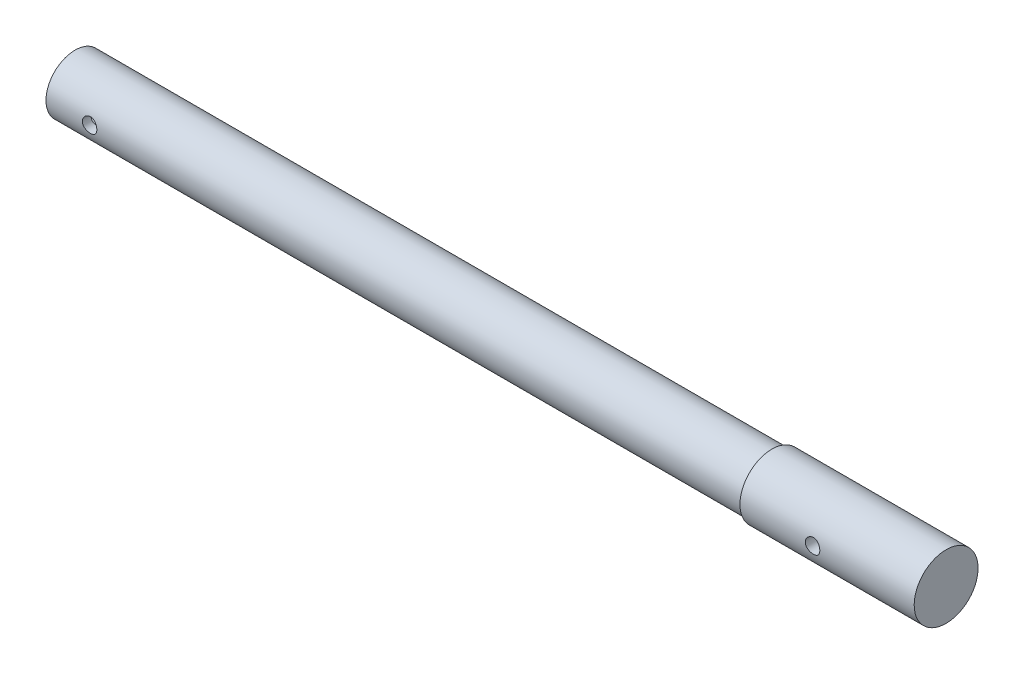
ISO-10303-21;
HEADER;
FILE_DESCRIPTION(('STEP AP214'),'2;1');
FILE_NAME('part.step','',(''),(''),'','','');
FILE_SCHEMA(('AUTOMOTIVE_DESIGN { 1 0 10303 214 1 1 1 1 }'));
ENDSEC;
DATA;
#1=APPLICATION_CONTEXT('core data for automotive mechanical design processes');
#2=APPLICATION_PROTOCOL_DEFINITION('international standard','automotive_design',2000,#1);
#3=PRODUCT_CONTEXT('',#1,'mechanical');
#4=PRODUCT('Part','Part','',(#3));
#5=PRODUCT_RELATED_PRODUCT_CATEGORY('part','',(#4));
#6=PRODUCT_DEFINITION_FORMATION('','',#4);
#7=PRODUCT_DEFINITION_CONTEXT('part definition',#1,'design');
#8=PRODUCT_DEFINITION('design','',#6,#7);
#9=PRODUCT_DEFINITION_SHAPE('','',#8);
#10=(LENGTH_UNIT() NAMED_UNIT(*) SI_UNIT(.MILLI.,.METRE.));
#11=(NAMED_UNIT(*) PLANE_ANGLE_UNIT() SI_UNIT($,.RADIAN.));
#12=(NAMED_UNIT(*) SI_UNIT($,.STERADIAN.) SOLID_ANGLE_UNIT());
#13=UNCERTAINTY_MEASURE_WITH_UNIT(LENGTH_MEASURE(1.E-05),#10,'distance_accuracy_value','');
#14=(GEOMETRIC_REPRESENTATION_CONTEXT(3) GLOBAL_UNCERTAINTY_ASSIGNED_CONTEXT((#13)) GLOBAL_UNIT_ASSIGNED_CONTEXT((#10,
#11,#12)) REPRESENTATION_CONTEXT('',''));
#15=CARTESIAN_POINT('',(0.,0.,0.));
#16=DIRECTION('',(0.,0.,1.));
#17=DIRECTION('',(1.,0.,0.));
#18=AXIS2_PLACEMENT_3D('',#15,#16,#17);
#19=CARTESIAN_POINT('',(0.,0.,0.));
#20=DIRECTION('',(-0.999999999999999,0.,0.));
#21=DIRECTION('',(0.,0.,1.));
#22=AXIS2_PLACEMENT_3D('',#19,#20,#21);
#23=PLANE('',#22);
#24=CARTESIAN_POINT('',(0.,0.,0.));
#25=DIRECTION('',(-0.999999999999999,0.,0.));
#26=DIRECTION('',(0.,0.,1.));
#27=AXIS2_PLACEMENT_3D('',#24,#25,#26);
#28=CIRCLE('',#27,11.);
#29=CARTESIAN_POINT('',(0.,0.,11.));
#30=VERTEX_POINT('',#29);
#31=EDGE_CURVE('E50',#30,#30,#28,.T.);
#32=ORIENTED_EDGE('',*,*,#31,.F.);
#33=EDGE_LOOP('',(#32));
#34=FACE_BOUND('',#33,.T.);
#35=ADVANCED_FACE('F34',(#34),#23,.F.);
#36=CARTESIAN_POINT('',(-299.999999999999,0.,0.));
#37=DIRECTION('',(-0.999999999999999,0.,0.));
#38=DIRECTION('',(0.,0.,1.));
#39=AXIS2_PLACEMENT_3D('',#36,#37,#38);
#40=CYLINDRICAL_SURFACE('',#39,11.);
#41=CARTESIAN_POINT('',(-32.5,0.,-11.));
#42=CARTESIAN_POINT('',(-32.5000045318264,0.138518278596904,-10.9999974735185));
#43=CARTESIAN_POINT('',(-32.5115512275769,0.277090172258007,-10.9973570934613));
#44=CARTESIAN_POINT('',(-32.5573794760617,0.550288594599317,-10.987079320306));
#45=CARTESIAN_POINT('',(-32.5916763959553,0.684912392220719,-10.9794385496265));
#46=CARTESIAN_POINT('',(-32.6818680486319,0.946227671984901,-10.9600095312293));
#47=CARTESIAN_POINT('',(-32.7377393279807,1.07292759495646,-10.9482257885674));
#48=CARTESIAN_POINT('',(-32.8694171133808,1.31515227582564,-10.921778201627));
#49=CARTESIAN_POINT('',(-32.9452234208424,1.4306771450318,-10.9071143860398));
#50=CARTESIAN_POINT('',(-33.1160020446067,1.64926760444636,-10.8762265816814));
#51=CARTESIAN_POINT('',(-33.211252573475,1.75211293892047,-10.8599819758326));
#52=CARTESIAN_POINT('',(-33.4176189741372,1.94051389816609,-10.827906511833));
#53=CARTESIAN_POINT('',(-33.5287363506944,2.02606788121783,-10.8120756930933));
#54=CARTESIAN_POINT('',(-33.7653320552837,2.17844599401786,-10.7824158369221));
#55=CARTESIAN_POINT('',(-33.8909669963058,2.24503254356573,-10.7686131580577));
#56=CARTESIAN_POINT('',(-34.1520095005816,2.35606069717868,-10.7448696147509));
#57=CARTESIAN_POINT('',(-34.2874157920616,2.40050517717748,-10.7349282488167));
#58=CARTESIAN_POINT('',(-34.5617591871165,2.46525349412717,-10.720243446983));
#59=CARTESIAN_POINT('',(-34.7005992631225,2.48594892680751,-10.715415797339));
#60=CARTESIAN_POINT('',(-34.9798582272131,2.50382988451486,-10.7112523406768));
#61=CARTESIAN_POINT('',(-35.1202769026623,2.50101853886554,-10.711915802658));
#62=CARTESIAN_POINT('',(-35.3957728833487,2.47228016958763,-10.7185835035919));
#63=CARTESIAN_POINT('',(-35.5309009061949,2.44681104599436,-10.7244819412976));
#64=CARTESIAN_POINT('',(-35.7949144861548,2.37420684920499,-10.7407873672743));
#65=CARTESIAN_POINT('',(-35.9237996676272,2.32707047404286,-10.7511946264744));
#66=CARTESIAN_POINT('',(-36.1729406718105,2.21205734402542,-10.7754474384537));
#67=CARTESIAN_POINT('',(-36.2931135177637,2.14400712086005,-10.7893215597825));
#68=CARTESIAN_POINT('',(-36.520502553111,1.98921977920406,-10.8189276843241));
#69=CARTESIAN_POINT('',(-36.6277168402639,1.90247992237133,-10.8346599596346));
#70=CARTESIAN_POINT('',(-36.828778561821,1.71036518003516,-10.866661528725));
#71=CARTESIAN_POINT('',(-36.9222544265163,1.60460166742826,-10.882934773515));
#72=CARTESIAN_POINT('',(-37.0902058887071,1.37871229840971,-10.9138502597158));
#73=CARTESIAN_POINT('',(-37.1646810866995,1.2585861400908,-10.9284924668293));
#74=CARTESIAN_POINT('',(-37.2926203879715,1.00690799179916,-10.9545497424637));
#75=CARTESIAN_POINT('',(-37.3460327736223,0.875328834348154,-10.9659568484873));
#76=CARTESIAN_POINT('',(-37.4298840058679,0.604745122491692,-10.9841998956698));
#77=CARTESIAN_POINT('',(-37.4603264658222,0.46574173966372,-10.9910365557784));
#78=CARTESIAN_POINT('',(-37.4968262374727,0.187439840192736,-10.9992650071756));
#79=CARTESIAN_POINT('',(-37.5033906913167,0.0482110923370398,-11.0007700184113));
#80=CARTESIAN_POINT('',(-37.4933269601471,-0.229353886680108,-10.9984842255063));
#81=CARTESIAN_POINT('',(-37.476700480594,-0.367690182720868,-10.9946938107912));
#82=CARTESIAN_POINT('',(-37.4211468330946,-0.637841677218467,-10.9823148103741));
#83=CARTESIAN_POINT('',(-37.3824884535562,-0.769715036814428,-10.973784087055));
#84=CARTESIAN_POINT('',(-37.2842689725429,-1.02510393087761,-10.9528806132367));
#85=CARTESIAN_POINT('',(-37.2247059957468,-1.14861871432291,-10.9405075180554));
#86=CARTESIAN_POINT('',(-37.0853308564447,-1.38586085256058,-10.9130143275094));
#87=CARTESIAN_POINT('',(-37.0052243732268,-1.4994106852272,-10.8978552985532));
#88=CARTESIAN_POINT('',(-36.8274206715598,-1.71163773579052,-10.866546095646));
#89=CARTESIAN_POINT('',(-36.7297209734532,-1.8103128535797,-10.8503957821912));
#90=CARTESIAN_POINT('',(-36.5171690348666,-1.99201706218097,-10.8185287714487));
#91=CARTESIAN_POINT('',(-36.4020127582132,-2.07469366594063,-10.8028272119253));
#92=CARTESIAN_POINT('',(-36.1591536093297,-2.21953814406553,-10.7740023321604));
#93=CARTESIAN_POINT('',(-36.0314512920404,-2.28170692501018,-10.7608788979592));
#94=CARTESIAN_POINT('',(-35.7678195304311,-2.38333597241929,-10.7388274870674));
#95=CARTESIAN_POINT('',(-35.6319426762566,-2.42292716221706,-10.7298753781702));
#96=CARTESIAN_POINT('',(-35.3552330933009,-2.47865258340366,-10.7171411058581));
#97=CARTESIAN_POINT('',(-35.2144012348636,-2.49479091341616,-10.7133580391079));
#98=CARTESIAN_POINT('',(-34.9353413806891,-2.50296739214167,-10.7114502943222));
#99=CARTESIAN_POINT('',(-34.7971304006664,-2.49556548501073,-10.7131941458177));
#100=CARTESIAN_POINT('',(-34.5239810898117,-2.45813115403285,-10.7218446846914));
#101=CARTESIAN_POINT('',(-34.3890427138895,-2.4280990421701,-10.7287513008948));
#102=CARTESIAN_POINT('',(-34.1267566026337,-2.3465369236061,-10.7468826027048));
#103=CARTESIAN_POINT('',(-33.9993803088585,-2.29509457527996,-10.758089666867));
#104=CARTESIAN_POINT('',(-33.7549852930994,-2.17224536606883,-10.783564723281));
#105=CARTESIAN_POINT('',(-33.6379677496745,-2.10083623731226,-10.7978330631965));
#106=CARTESIAN_POINT('',(-33.4148655723447,-1.93824996891053,-10.828211072634));
#107=CARTESIAN_POINT('',(-33.3090742777926,-1.84667645642838,-10.8443540558786));
#108=CARTESIAN_POINT('',(-33.114176814918,-1.6471562893242,-10.8764454859305));
#109=CARTESIAN_POINT('',(-33.025074529034,-1.53920583540677,-10.8923938866664));
#110=CARTESIAN_POINT('',(-32.8648619397663,-1.30814060515057,-10.9225693389041));
#111=CARTESIAN_POINT('',(-32.7940261766668,-1.18483162187621,-10.9367686161711));
#112=CARTESIAN_POINT('',(-32.674200029337,-0.927755967711699,-10.9615640551399));
#113=CARTESIAN_POINT('',(-32.6251920052133,-0.793997844337698,-10.9721631246672));
#114=CARTESIAN_POINT('',(-32.5587720938238,-0.550163071539619,-10.9867559512784));
#115=CARTESIAN_POINT('',(-32.5367760123107,-0.441368111138487,-10.9916908558499));
#116=CARTESIAN_POINT('',(-32.5073885264206,-0.221726814930916,-10.9983138080738));
#117=CARTESIAN_POINT('',(-32.4999963723808,-0.110880584717101,-11.0000020223883));
#118=CARTESIAN_POINT('',(-32.5,0.,-11.));
#119=B_SPLINE_CURVE_WITH_KNOTS('',3,(#41,#42,#43,#44,#45,#46,#47,#48,#49,#50,#51,#52,#53,#54,
#55,#56,#57,#58,#59,#60,#61,#62,#63,#64,#65,#66,#67,#68,#69,#70,#71,#72,#73,#74,#75,#76,#77,#78,
#79,#80,#81,#82,#83,#84,#85,#86,#87,#88,#89,#90,#91,#92,#93,#94,#95,#96,#97,#98,#99,#100,#101,
#102,#103,#104,#105,#106,#107,#108,#109,#110,#111,#112,#113,#114,#115,#116,#117,#118),
.UNSPECIFIED.,.T.,.F.,(4,2,2,2,2,2,2,2,2,2,2,2,2,2,2,2,2,2,2,2,2,2,2,2,2,2,2,2,2,2,2,2,2,2,2,2,
2,2,4),(0.,0.415148849633312,0.830578406996924,1.24555761755317,1.66053269430522,
2.08192389396808,2.50335508365802,2.92985362973412,3.35629676538237,3.77560244898082,
4.19485231368759,4.60581714174236,5.01680666753972,5.43130157438849,5.84585725297976,
6.27011531803702,6.69438230269861,7.11968464096645,7.54492006169893,7.9610694191676,
8.37718817463625,8.78833576149035,9.19952024123082,9.61696129328766,10.0344612272567,
10.4603132154039,10.8861463755948,11.3094844190899,11.732748471094,12.1460204395145,
12.5592867105954,12.9708773657615,13.382514789318,13.8031102578591,14.2238034502007,
14.6504927745347,15.0768366452216,15.4091704772436,15.7414872491401),.UNSPECIFIED.);
#120=CARTESIAN_POINT('',(-32.5,0.,-11.));
#121=VERTEX_POINT('',#120);
#122=EDGE_CURVE('E10',#121,#121,#119,.T.);
#123=ORIENTED_EDGE('',*,*,#122,.T.);
#124=EDGE_LOOP('',(#123));
#125=FACE_BOUND('',#124,.T.);
#126=CARTESIAN_POINT('',(-32.5,0.,11.));
#127=CARTESIAN_POINT('',(-32.5000045318264,-0.138518278596916,10.9999974735186));
#128=CARTESIAN_POINT('',(-32.5115512275769,-0.27709017225802,10.9973570934613));
#129=CARTESIAN_POINT('',(-32.5573794760617,-0.55028859459933,10.987079320306));
#130=CARTESIAN_POINT('',(-32.5916763959553,-0.684912392220732,10.9794385496265));
#131=CARTESIAN_POINT('',(-32.6818680486319,-0.946227671984921,10.9600095312294));
#132=CARTESIAN_POINT('',(-32.7377393279807,-1.07292759495649,10.9482257885674));
#133=CARTESIAN_POINT('',(-32.8694171133808,-1.31515227582568,10.921778201627));
#134=CARTESIAN_POINT('',(-32.9452234208424,-1.43067714503184,10.9071143860399));
#135=CARTESIAN_POINT('',(-33.1160020446066,-1.6492676044464,10.8762265816814));
#136=CARTESIAN_POINT('',(-33.211252573475,-1.75211293892051,10.8599819758326));
#137=CARTESIAN_POINT('',(-33.4176189741372,-1.94051389816612,10.827906511833));
#138=CARTESIAN_POINT('',(-33.5287363506944,-2.02606788121785,10.8120756930933));
#139=CARTESIAN_POINT('',(-33.7653320552837,-2.17844599401789,10.7824158369221));
#140=CARTESIAN_POINT('',(-33.8909669963058,-2.24503254356577,10.7686131580577));
#141=CARTESIAN_POINT('',(-34.1520095005816,-2.35606069717871,10.7448696147509));
#142=CARTESIAN_POINT('',(-34.2874157920616,-2.4005051771775,10.7349282488168));
#143=CARTESIAN_POINT('',(-34.5617591871165,-2.46525349412719,10.7202434469831));
#144=CARTESIAN_POINT('',(-34.7005992631225,-2.48594892680756,10.715415797339));
#145=CARTESIAN_POINT('',(-34.9798582272131,-2.5038298845149,10.7112523406768));
#146=CARTESIAN_POINT('',(-35.1202769026623,-2.50101853886555,10.7119158026581));
#147=CARTESIAN_POINT('',(-35.3957728833487,-2.47228016958765,10.718583503592));
#148=CARTESIAN_POINT('',(-35.5309009061949,-2.44681104599439,10.7244819412976));
#149=CARTESIAN_POINT('',(-35.7949144861548,-2.37420684920503,10.7407873672743));
#150=CARTESIAN_POINT('',(-35.9237996676272,-2.3270704740429,10.7511946264744));
#151=CARTESIAN_POINT('',(-36.1729406718105,-2.21205734402545,10.7754474384537));
#152=CARTESIAN_POINT('',(-36.2931135177637,-2.14400712086009,10.7893215597825));
#153=CARTESIAN_POINT('',(-36.5205025531111,-1.98921977920409,10.8189276843241));
#154=CARTESIAN_POINT('',(-36.6277168402639,-1.90247992237135,10.8346599596346));
#155=CARTESIAN_POINT('',(-36.828778561821,-1.71036518003517,10.8666615287251));
#156=CARTESIAN_POINT('',(-36.9222544265163,-1.60460166742828,10.882934773515));
#157=CARTESIAN_POINT('',(-37.0902058887071,-1.37871229840973,10.9138502597158));
#158=CARTESIAN_POINT('',(-37.1646810866995,-1.25858614009081,10.9284924668294));
#159=CARTESIAN_POINT('',(-37.2926203879715,-1.00690799179917,10.9545497424638));
#160=CARTESIAN_POINT('',(-37.3460327736223,-0.875328834348167,10.9659568484873));
#161=CARTESIAN_POINT('',(-37.4298840058679,-0.604745122491713,10.9841998956698));
#162=CARTESIAN_POINT('',(-37.4603264658222,-0.465741739663744,10.9910365557784));
#163=CARTESIAN_POINT('',(-37.4968262374727,-0.187439840192761,10.9992650071756));
#164=CARTESIAN_POINT('',(-37.5033906913167,-0.048211092337063,11.0007700184113));
#165=CARTESIAN_POINT('',(-37.4933269601471,0.22935388668009,10.9984842255063));
#166=CARTESIAN_POINT('',(-37.476700480594,0.367690182720853,10.9946938107912));
#167=CARTESIAN_POINT('',(-37.4211468330946,0.637841677218447,10.9823148103742));
#168=CARTESIAN_POINT('',(-37.3824884535562,0.769715036814401,10.973784087055));
#169=CARTESIAN_POINT('',(-37.2842689725429,1.02510393087758,10.9528806132367));
#170=CARTESIAN_POINT('',(-37.2247059957468,1.14861871432287,10.9405075180555));
#171=CARTESIAN_POINT('',(-37.0853308564447,1.38586085256054,10.9130143275095));
#172=CARTESIAN_POINT('',(-37.0052243732268,1.49941068522716,10.8978552985532));
#173=CARTESIAN_POINT('',(-36.8274206715598,1.71163773579048,10.866546095646));
#174=CARTESIAN_POINT('',(-36.7297209734532,1.81031285357967,10.8503957821913));
#175=CARTESIAN_POINT('',(-36.5171690348666,1.99201706218093,10.8185287714487));
#176=CARTESIAN_POINT('',(-36.4020127582132,2.07469366594058,10.8028272119253));
#177=CARTESIAN_POINT('',(-36.1591536093297,2.2195381440655,10.7740023321604));
#178=CARTESIAN_POINT('',(-36.0314512920404,2.28170692501016,10.7608788979593));
#179=CARTESIAN_POINT('',(-35.7678195304311,2.38333597241927,10.7388274870674));
#180=CARTESIAN_POINT('',(-35.6319426762566,2.42292716221702,10.7298753781702));
#181=CARTESIAN_POINT('',(-35.3552330933009,2.47865258340363,10.7171411058581));
#182=CARTESIAN_POINT('',(-35.2144012348636,2.49479091341615,10.713358039108));
#183=CARTESIAN_POINT('',(-34.9353413806891,2.50296739214166,10.7114502943223));
#184=CARTESIAN_POINT('',(-34.7971304006664,2.4955654850107,10.7131941458177));
#185=CARTESIAN_POINT('',(-34.5239810898117,2.4581311540328,10.7218446846914));
#186=CARTESIAN_POINT('',(-34.3890427138895,2.42809904217007,10.7287513008948));
#187=CARTESIAN_POINT('',(-34.1267566026337,2.34653692360607,10.7468826027049));
#188=CARTESIAN_POINT('',(-33.9993803088585,2.29509457527993,10.758089666867));
#189=CARTESIAN_POINT('',(-33.7549852930994,2.17224536606878,10.7835647232811));
#190=CARTESIAN_POINT('',(-33.6379677496745,2.10083623731222,10.7978330631966));
#191=CARTESIAN_POINT('',(-33.4148655723447,1.93824996891048,10.8282110726341));
#192=CARTESIAN_POINT('',(-33.3090742777926,1.84667645642833,10.8443540558786));
#193=CARTESIAN_POINT('',(-33.114176814918,1.64715628932417,10.8764454859305));
#194=CARTESIAN_POINT('',(-33.025074529034,1.53920583540675,10.8923938866665));
#195=CARTESIAN_POINT('',(-32.8648619397663,1.30814060515056,10.9225693389041));
#196=CARTESIAN_POINT('',(-32.7940261766668,1.18483162187619,10.9367686161711));
#197=CARTESIAN_POINT('',(-32.674200029337,0.927755967711683,10.9615640551399));
#198=CARTESIAN_POINT('',(-32.6251920052133,0.793997844337689,10.9721631246672));
#199=CARTESIAN_POINT('',(-32.5587720938238,0.550163071539611,10.9867559512784));
#200=CARTESIAN_POINT('',(-32.5367760123107,0.441368111138475,10.9916908558499));
#201=CARTESIAN_POINT('',(-32.5073885264206,0.221726814930901,10.9983138080738));
#202=CARTESIAN_POINT('',(-32.4999963723808,0.110880584717087,11.0000020223883));
#203=CARTESIAN_POINT('',(-32.5,0.,11.));
#204=B_SPLINE_CURVE_WITH_KNOTS('',3,(#126,#127,#128,#129,#130,#131,#132,#133,#134,#135,#136,
#137,#138,#139,#140,#141,#142,#143,#144,#145,#146,#147,#148,#149,#150,#151,#152,#153,#154,#155,
#156,#157,#158,#159,#160,#161,#162,#163,#164,#165,#166,#167,#168,#169,#170,#171,#172,#173,#174,
#175,#176,#177,#178,#179,#180,#181,#182,#183,#184,#185,#186,#187,#188,#189,#190,#191,#192,#193,
#194,#195,#196,#197,#198,#199,#200,#201,#202,#203),.UNSPECIFIED.,.T.,.F.,(4,2,2,2,2,2,2,2,2,2,2,
2,2,2,2,2,2,2,2,2,2,2,2,2,2,2,2,2,2,2,2,2,2,2,2,2,2,2,4),(0.,0.415148849633311,
0.830578406996924,1.24555761755319,1.66053269430525,2.08192389396809,2.50335508365803,
2.92985362973414,3.35629676538238,3.77560244898084,4.19485231368761,4.60581714174238,
5.01680666753974,5.43130157438852,5.84585725297979,6.27011531803706,6.69438230269865,
7.11968464096649,7.54492006169895,7.96106941916763,8.37718817463629,8.78833576149037,
9.19952024123083,9.61696129328767,10.0344612272567,10.460313215404,10.8861463755948,
11.3094844190899,11.732748471094,12.1460204395146,12.5592867105954,12.9708773657615,
13.382514789318,13.8031102578591,14.2238034502007,14.6504927745347,15.0768366452216,
15.4091704772436,15.74148724914),.UNSPECIFIED.);
#205=CARTESIAN_POINT('',(-32.5,0.,11.));
#206=VERTEX_POINT('',#205);
#207=EDGE_CURVE('E45',#206,#206,#204,.T.);
#208=ORIENTED_EDGE('',*,*,#207,.T.);
#209=EDGE_LOOP('',(#208));
#210=FACE_BOUND('',#209,.T.);
#211=CARTESIAN_POINT('',(-60.,0.,0.));
#212=DIRECTION('',(-0.999999999999999,0.,0.));
#213=DIRECTION('',(0.,0.,1.));
#214=AXIS2_PLACEMENT_3D('',#211,#212,#213);
#215=CIRCLE('',#214,11.);
#216=CARTESIAN_POINT('',(-60.,0.,11.));
#217=VERTEX_POINT('',#216);
#218=EDGE_CURVE('E122',#217,#217,#215,.T.);
#219=ORIENTED_EDGE('',*,*,#218,.F.);
#220=EDGE_LOOP('',(#219));
#221=FACE_BOUND('',#220,.T.);
#222=ORIENTED_EDGE('',*,*,#31,.T.);
#223=EDGE_LOOP('',(#222));
#224=FACE_BOUND('',#223,.T.);
#225=ADVANCED_FACE('F61',(#125,#210,#221,#224),#40,.T.);
#226=CARTESIAN_POINT('',(-60.,11.,0.));
#227=DIRECTION('',(0.999999999999999,0.,0.));
#228=DIRECTION('',(0.,0.,-1.));
#229=AXIS2_PLACEMENT_3D('',#226,#227,#228);
#230=PLANE('',#229);
#231=CARTESIAN_POINT('',(-60.,0.,0.));
#232=DIRECTION('',(-0.999999999999999,0.,0.));
#233=DIRECTION('',(0.,0.,1.));
#234=AXIS2_PLACEMENT_3D('',#231,#232,#233);
#235=CIRCLE('',#234,10.);
#236=CARTESIAN_POINT('',(-60.,0.,10.));
#237=VERTEX_POINT('',#236);
#238=EDGE_CURVE('E124',#237,#237,#235,.T.);
#239=ORIENTED_EDGE('',*,*,#238,.F.);
#240=EDGE_LOOP('',(#239));
#241=FACE_BOUND('',#240,.T.);
#242=ORIENTED_EDGE('',*,*,#218,.T.);
#243=EDGE_LOOP('',(#242));
#244=FACE_BOUND('',#243,.T.);
#245=ADVANCED_FACE('F80',(#241,#244),#230,.F.);
#246=CARTESIAN_POINT('',(-299.999999999999,0.,0.));
#247=DIRECTION('',(-0.999999999999999,0.,0.));
#248=DIRECTION('',(0.,0.,1.));
#249=AXIS2_PLACEMENT_3D('',#246,#247,#248);
#250=CYLINDRICAL_SURFACE('',#249,9.99999999999999);
#251=CARTESIAN_POINT('',(-282.5,0.,10.));
#252=CARTESIAN_POINT('',(-282.50000387623,-0.138126814449554,9.99999766446688));
#253=CARTESIAN_POINT('',(-282.511485917956,-0.276296929717936,9.99710963553043));
#254=CARTESIAN_POINT('',(-282.557041918845,-0.548677206284232,9.98586856383157));
#255=CARTESIAN_POINT('',(-282.591128682563,-0.682885078117928,9.97751242366628));
#256=CARTESIAN_POINT('',(-282.680732089103,-0.943368120304304,9.95626043886721));
#257=CARTESIAN_POINT('',(-282.736222997858,-1.06965260571664,9.94337004736763));
#258=CARTESIAN_POINT('',(-282.866968983408,-1.31112021984068,9.91442239679369));
#259=CARTESIAN_POINT('',(-282.942224726864,-1.42630297391461,9.89836503090263));
#260=CARTESIAN_POINT('',(-283.11200131609,-1.64466987883488,9.86445689319491));
#261=CARTESIAN_POINT('',(-283.206852624931,-1.74759281676842,9.84657845246877));
#262=CARTESIAN_POINT('',(-283.412420341515,-1.93624821200553,9.8112270019656));
#263=CARTESIAN_POINT('',(-283.523138538244,-2.02197872824868,9.79375403816448));
#264=CARTESIAN_POINT('',(-283.759325377895,-2.17504423799833,9.76091292830283));
#265=CARTESIAN_POINT('',(-283.884988718014,-2.24208702654191,9.74557990774684));
#266=CARTESIAN_POINT('',(-284.146247352766,-2.35399484758459,9.71915824696693));
#267=CARTESIAN_POINT('',(-284.281841055553,-2.39886342573361,9.70806892824033));
#268=CARTESIAN_POINT('',(-284.556239163669,-2.46425806134132,9.6916746116054));
#269=CARTESIAN_POINT('',(-284.69492482673,-2.48525378055345,9.68625818328351));
#270=CARTESIAN_POINT('',(-284.973947614998,-2.5037696251107,9.68148937432651));
#271=CARTESIAN_POINT('',(-285.11428446782,-2.50129356969688,9.68213600713215));
#272=CARTESIAN_POINT('',(-285.389026346242,-2.47331087439956,9.68932009194695));
#273=CARTESIAN_POINT('',(-285.523492702442,-2.44836390031778,9.69571438345487));
#274=CARTESIAN_POINT('',(-285.786268418185,-2.37704031150504,9.71344516118447));
#275=CARTESIAN_POINT('',(-285.914577338381,-2.33066217011568,9.72478199948733));
#276=CARTESIAN_POINT('',(-286.162896693753,-2.21731579656199,9.75125189842767));
#277=CARTESIAN_POINT('',(-286.282810286316,-2.15014444538824,9.76642212449692));
#278=CARTESIAN_POINT('',(-286.509864516261,-1.99726046002495,9.79882851409984));
#279=CARTESIAN_POINT('',(-286.617002913445,-1.91154458134809,9.81606503891048));
#280=CARTESIAN_POINT('',(-286.818672692824,-1.72110570780206,9.85126467566487));
#281=CARTESIAN_POINT('',(-286.912757483435,-1.61591043027648,9.8692344913));
#282=CARTESIAN_POINT('',(-287.082035404106,-1.39101986250622,9.90343275964592));
#283=CARTESIAN_POINT('',(-287.157227957106,-1.27132412951329,9.9196611591568));
#284=CARTESIAN_POINT('',(-287.28675097704,-1.02019314780236,9.94862886823652));
#285=CARTESIAN_POINT('',(-287.341008900424,-0.888718988681079,9.96135600212878));
#286=CARTESIAN_POINT('',(-287.426528842849,-0.618126680238168,9.9817986165236));
#287=CARTESIAN_POINT('',(-287.457795260696,-0.479009998584165,9.9895150556547));
#288=CARTESIAN_POINT('',(-287.495762609264,-0.200899950650064,9.99892498785626));
#289=CARTESIAN_POINT('',(-287.503071710125,-0.0619945333137042,10.0007675584713));
#290=CARTESIAN_POINT('',(-287.494584996574,0.215054791335818,9.99864674690753));
#291=CARTESIAN_POINT('',(-287.478791262001,0.35319876607429,9.99468388736423));
#292=CARTESIAN_POINT('',(-287.425048486014,0.622690447960789,9.9814930187892));
#293=CARTESIAN_POINT('',(-287.387431227538,0.754108531614571,9.97234390309646));
#294=CARTESIAN_POINT('',(-287.291488193285,1.00876215408751,9.94981177723595));
#295=CARTESIAN_POINT('',(-287.233160326144,1.13199686505439,9.93642833949967));
#296=CARTESIAN_POINT('',(-287.096273118542,1.36920522404969,9.90655513210372));
#297=CARTESIAN_POINT('',(-287.017373146005,1.48297573639294,9.89001445611));
#298=CARTESIAN_POINT('',(-286.842016818671,1.69587768940553,9.85574181979585));
#299=CARTESIAN_POINT('',(-286.74555743397,1.79500659828875,9.83800965421577));
#300=CARTESIAN_POINT('',(-286.534996731927,1.97831761345415,9.80281594932497));
#301=CARTESIAN_POINT('',(-286.420520495,2.06207311270187,9.78537173637461));
#302=CARTESIAN_POINT('',(-286.178778942552,2.20918459835607,9.75321463970069));
#303=CARTESIAN_POINT('',(-286.051514195049,2.27254149026902,9.73850163474942));
#304=CARTESIAN_POINT('',(-285.788490462656,2.37658570101223,9.71363491194666));
#305=CARTESIAN_POINT('',(-285.652787286146,2.41740732773932,9.70345425375808));
#306=CARTESIAN_POINT('',(-285.376150603574,2.47557609990492,9.68877906706584));
#307=CARTESIAN_POINT('',(-285.235218248297,2.49292837912655,9.68428329504045));
#308=CARTESIAN_POINT('',(-284.95646496023,2.50339765056084,9.68158168701613));
#309=CARTESIAN_POINT('',(-284.818670941455,2.49719649630131,9.68319887888034));
#310=CARTESIAN_POINT('',(-284.546160185556,2.46229546385367,9.69213181672142));
#311=CARTESIAN_POINT('',(-284.411443386644,2.43359603781101,9.6994474481773));
#312=CARTESIAN_POINT('',(-284.149652568223,2.35488553240499,9.7188543447322));
#313=CARTESIAN_POINT('',(-284.022537824599,2.30500234113404,9.73091692061055));
#314=CARTESIAN_POINT('',(-283.77839102881,2.18544152267503,9.7584625954084));
#315=CARTESIAN_POINT('',(-283.661360378021,2.11576115005696,9.77394616867809));
#316=CARTESIAN_POINT('',(-283.437408951663,1.95644624772856,9.80709390439339));
#317=CARTESIAN_POINT('',(-283.330831544293,1.86633860485372,9.82480441386302));
#318=CARTESIAN_POINT('',(-283.134088258674,1.66964895198286,9.86013378743769));
#319=CARTESIAN_POINT('',(-283.043926283145,1.56306303543526,9.87775262878423));
#320=CARTESIAN_POINT('',(-282.880981152392,1.33411264450434,9.91129426079451));
#321=CARTESIAN_POINT('',(-282.808542310547,1.21149737052729,9.92718055609783));
#322=CARTESIAN_POINT('',(-282.685420895099,0.95544343251742,9.95508208291861));
#323=CARTESIAN_POINT('',(-282.634722732252,0.822012605727887,9.96710008666304));
#324=CARTESIAN_POINT('',(-282.56404694945,0.574017088739116,9.98413432609238));
#325=CARTESIAN_POINT('',(-282.540081261577,0.460633618180103,9.99004308421151));
#326=CARTESIAN_POINT('',(-282.50805676063,0.231510119227123,9.9979767538658));
#327=CARTESIAN_POINT('',(-282.499996751157,0.115770268737682,10.0000019575149));
#328=CARTESIAN_POINT('',(-282.5,0.,10.));
#329=B_SPLINE_CURVE_WITH_KNOTS('',3,(#251,#252,#253,#254,#255,#256,#257,#258,#259,#260,#261,
#262,#263,#264,#265,#266,#267,#268,#269,#270,#271,#272,#273,#274,#275,#276,#277,#278,#279,#280,
#281,#282,#283,#284,#285,#286,#287,#288,#289,#290,#291,#292,#293,#294,#295,#296,#297,#298,#299,
#300,#301,#302,#303,#304,#305,#306,#307,#308,#309,#310,#311,#312,#313,#314,#315,#316,#317,#318,
#319,#320,#321,#322,#323,#324,#325,#326,#327,#328),.UNSPECIFIED.,.T.,.F.,(4,2,2,2,2,2,2,2,2,2,2,
2,2,2,2,2,2,2,2,2,2,2,2,2,2,2,2,2,2,2,2,2,2,2,2,2,2,2,4),(0.,0.413956187453151,
0.828147062939819,1.24184150381016,1.65554990028223,2.07690725728564,2.49831215966769,
2.92597745909683,3.35357435282285,3.77260491835117,4.19156730193359,4.60037495017225,
5.00921172448935,5.42217546462004,5.83521151399143,6.26002501620572,6.68485149269284,
7.11113715020731,7.53734122819948,7.95263848254336,8.36789835193446,8.77700457528938,
9.18615212209362,9.6025597928113,10.0190393835225,10.4457418201301,10.8724253125473,
11.2965375769765,11.720557054305,12.132396340075,12.5442273493653,12.9536066760889,
13.3630428023798,13.78315960693,14.2033761629384,14.6312030917579,15.058722730454,
15.405704049134,15.7526592674821),.UNSPECIFIED.);
#330=CARTESIAN_POINT('',(-282.5,0.,10.));
#331=VERTEX_POINT('',#330);
#332=EDGE_CURVE('E88',#331,#331,#329,.T.);
#333=ORIENTED_EDGE('',*,*,#332,.T.);
#334=EDGE_LOOP('',(#333));
#335=FACE_BOUND('',#334,.T.);
#336=CARTESIAN_POINT('',(-282.5,0.,-9.99999999999998));
#337=CARTESIAN_POINT('',(-282.50000387623,0.138126814449529,-9.99999766446685));
#338=CARTESIAN_POINT('',(-282.511485917956,0.276296929717913,-9.99710963553042));
#339=CARTESIAN_POINT('',(-282.557041918845,0.548677206284213,-9.98586856383156));
#340=CARTESIAN_POINT('',(-282.591128682563,0.682885078117911,-9.97751242366625));
#341=CARTESIAN_POINT('',(-282.680732089103,0.94336812030429,-9.9562604388672));
#342=CARTESIAN_POINT('',(-282.736222997858,1.06965260571663,-9.94337004736763));
#343=CARTESIAN_POINT('',(-282.866968983408,1.31112021984067,-9.91442239679368));
#344=CARTESIAN_POINT('',(-282.942224726864,1.42630297391459,-9.89836503090259));
#345=CARTESIAN_POINT('',(-283.11200131609,1.64466987883486,-9.86445689319487));
#346=CARTESIAN_POINT('',(-283.206852624931,1.74759281676841,-9.84657845246875));
#347=CARTESIAN_POINT('',(-283.412420341515,1.93624821200551,-9.81122700196559));
#348=CARTESIAN_POINT('',(-283.523138538244,2.02197872824866,-9.79375403816445));
#349=CARTESIAN_POINT('',(-283.759325377895,2.17504423799831,-9.7609129283028));
#350=CARTESIAN_POINT('',(-283.884988718014,2.2420870265419,-9.74557990774683));
#351=CARTESIAN_POINT('',(-284.146247352766,2.35399484758457,-9.71915824696692));
#352=CARTESIAN_POINT('',(-284.281841055553,2.39886342573357,-9.70806892824029));
#353=CARTESIAN_POINT('',(-284.556239163669,2.46425806134129,-9.69167461160536));
#354=CARTESIAN_POINT('',(-284.69492482673,2.48525378055343,-9.6862581832835));
#355=CARTESIAN_POINT('',(-284.973947614998,2.50376962511069,-9.6814893743265));
#356=CARTESIAN_POINT('',(-285.11428446782,2.50129356969686,-9.68213600713213));
#357=CARTESIAN_POINT('',(-285.389026346242,2.47331087439953,-9.68932009194694));
#358=CARTESIAN_POINT('',(-285.523492702442,2.44836390031776,-9.69571438345488));
#359=CARTESIAN_POINT('',(-285.786268418185,2.37704031150503,-9.71344516118443));
#360=CARTESIAN_POINT('',(-285.914577338381,2.33066217011567,-9.72478199948723));
#361=CARTESIAN_POINT('',(-286.162896693753,2.21731579656199,-9.75125189842758));
#362=CARTESIAN_POINT('',(-286.282810286316,2.15014444538823,-9.7664221244969));
#363=CARTESIAN_POINT('',(-286.509864516261,1.99726046002495,-9.79882851409983));
#364=CARTESIAN_POINT('',(-286.617002913445,1.91154458134809,-9.81606503891043));
#365=CARTESIAN_POINT('',(-286.818672692824,1.72110570780206,-9.85126467566481));
#366=CARTESIAN_POINT('',(-286.912757483435,1.61591043027648,-9.86923449129999));
#367=CARTESIAN_POINT('',(-287.082035404106,1.39101986250621,-9.90343275964591));
#368=CARTESIAN_POINT('',(-287.157227957106,1.27132412951327,-9.91966115915676));
#369=CARTESIAN_POINT('',(-287.28675097704,1.02019314780234,-9.94862886823647));
#370=CARTESIAN_POINT('',(-287.341008900424,0.888718988681065,-9.96135600212876));
#371=CARTESIAN_POINT('',(-287.426528842849,0.618126680238163,-9.98179861652359));
#372=CARTESIAN_POINT('',(-287.457795260696,0.479009998584162,-9.98951505565467));
#373=CARTESIAN_POINT('',(-287.495762609264,0.200899950650059,-9.99892498785623));
#374=CARTESIAN_POINT('',(-287.503071710125,0.0619945333136953,-10.0007675584713));
#375=CARTESIAN_POINT('',(-287.494584996574,-0.215054791335835,-9.99864674690752));
#376=CARTESIAN_POINT('',(-287.478791262001,-0.353198766074312,-9.99468388736419));
#377=CARTESIAN_POINT('',(-287.425048486014,-0.62269044796082,-9.98149301878916));
#378=CARTESIAN_POINT('',(-287.387431227538,-0.754108531614606,-9.97234390309644));
#379=CARTESIAN_POINT('',(-287.291488193285,-1.00876215408755,-9.94981177723593));
#380=CARTESIAN_POINT('',(-287.233160326144,-1.13199686505443,-9.93642833949963));
#381=CARTESIAN_POINT('',(-287.096273118542,-1.36920522404973,-9.90655513210367));
#382=CARTESIAN_POINT('',(-287.017373146005,-1.48297573639297,-9.89001445610997));
#383=CARTESIAN_POINT('',(-286.842016818671,-1.69587768940555,-9.85574181979584));
#384=CARTESIAN_POINT('',(-286.74555743397,-1.79500659828877,-9.83800965421576));
#385=CARTESIAN_POINT('',(-286.534996731927,-1.97831761345417,-9.80281594932495));
#386=CARTESIAN_POINT('',(-286.420520495,-2.06207311270188,-9.7853717363746));
#387=CARTESIAN_POINT('',(-286.178778942552,-2.2091845983561,-9.75321463970067));
#388=CARTESIAN_POINT('',(-286.051514195049,-2.27254149026906,-9.73850163474939));
#389=CARTESIAN_POINT('',(-285.788490462656,-2.37658570101227,-9.71363491194663));
#390=CARTESIAN_POINT('',(-285.652787286146,-2.41740732773935,-9.70345425375807));
#391=CARTESIAN_POINT('',(-285.376150603574,-2.47557609990493,-9.68877906706582));
#392=CARTESIAN_POINT('',(-285.235218248297,-2.49292837912655,-9.6842832950404));
#393=CARTESIAN_POINT('',(-284.95646496023,-2.50339765056085,-9.68158168701609));
#394=CARTESIAN_POINT('',(-284.818670941455,-2.49719649630133,-9.68319887888032));
#395=CARTESIAN_POINT('',(-284.546160185556,-2.46229546385368,-9.6921318167214));
#396=CARTESIAN_POINT('',(-284.411443386644,-2.43359603781103,-9.69944744817726));
#397=CARTESIAN_POINT('',(-284.149652568223,-2.354885532405,-9.71885434473216));
#398=CARTESIAN_POINT('',(-284.022537824599,-2.30500234113406,-9.73091692061054));
#399=CARTESIAN_POINT('',(-283.77839102881,-2.18544152267505,-9.75846259540838));
#400=CARTESIAN_POINT('',(-283.661360378021,-2.11576115005699,-9.77394616867804));
#401=CARTESIAN_POINT('',(-283.437408951663,-1.9564462477286,-9.80709390439333));
#402=CARTESIAN_POINT('',(-283.330831544293,-1.86633860485374,-9.824804413863));
#403=CARTESIAN_POINT('',(-283.134088258674,-1.66964895198289,-9.86013378743768));
#404=CARTESIAN_POINT('',(-283.043926283145,-1.56306303543531,-9.8777526287842));
#405=CARTESIAN_POINT('',(-282.880981152392,-1.33411264450438,-9.91129426079448));
#406=CARTESIAN_POINT('',(-282.808542310547,-1.21149737052731,-9.92718055609782));
#407=CARTESIAN_POINT('',(-282.685420895099,-0.955443432517427,-9.95508208291858));
#408=CARTESIAN_POINT('',(-282.634722732252,-0.822012605727897,-9.96710008666297));
#409=CARTESIAN_POINT('',(-282.56404694945,-0.57401708873913,-9.98413432609233));
#410=CARTESIAN_POINT('',(-282.540081261577,-0.460633618180116,-9.99004308421148));
#411=CARTESIAN_POINT('',(-282.50805676063,-0.231510119227141,-9.99797675386579));
#412=CARTESIAN_POINT('',(-282.499996751157,-0.115770268737705,-10.0000019575149));
#413=CARTESIAN_POINT('',(-282.5,0.,-9.99999999999998));
#414=B_SPLINE_CURVE_WITH_KNOTS('',3,(#336,#337,#338,#339,#340,#341,#342,#343,#344,#345,#346,
#347,#348,#349,#350,#351,#352,#353,#354,#355,#356,#357,#358,#359,#360,#361,#362,#363,#364,#365,
#366,#367,#368,#369,#370,#371,#372,#373,#374,#375,#376,#377,#378,#379,#380,#381,#382,#383,#384,
#385,#386,#387,#388,#389,#390,#391,#392,#393,#394,#395,#396,#397,#398,#399,#400,#401,#402,#403,
#404,#405,#406,#407,#408,#409,#410,#411,#412,#413),.UNSPECIFIED.,.T.,.F.,(4,2,2,2,2,2,2,2,2,2,2,
2,2,2,2,2,2,2,2,2,2,2,2,2,2,2,2,2,2,2,2,2,2,2,2,2,2,2,4),(0.,0.413956187453158,
0.828147062939833,1.24184150381017,1.65554990028224,2.07690725728565,2.4983121596677,
2.92597745909684,3.35357435282286,3.77260491835118,4.1915673019336,4.60037495017226,
5.00921172448935,5.42217546462004,5.83521151399143,6.26002501620573,6.68485149269286,
7.11113715020732,7.53734122819947,7.95263848254337,8.36789835193448,8.77700457528941,
9.18615212209366,9.60255979281133,10.0190393835225,10.4457418201301,10.8724253125473,
11.2965375769765,11.720557054305,12.1323963400751,12.5442273493653,12.9536066760889,
13.3630428023799,13.78315960693,14.2033761629384,14.631203091758,15.058722730454,
15.405704049134,15.7526592674821),.UNSPECIFIED.);
#415=CARTESIAN_POINT('',(-282.5,0.,-9.99999999999998));
#416=VERTEX_POINT('',#415);
#417=EDGE_CURVE('E84',#416,#416,#414,.T.);
#418=ORIENTED_EDGE('',*,*,#417,.T.);
#419=EDGE_LOOP('',(#418));
#420=FACE_BOUND('',#419,.T.);
#421=CARTESIAN_POINT('',(-299.999999999999,0.,0.));
#422=DIRECTION('',(-0.999999999999999,0.,0.));
#423=DIRECTION('',(0.,0.,1.));
#424=AXIS2_PLACEMENT_3D('',#421,#422,#423);
#425=CIRCLE('',#424,9.99999999999997);
#426=CARTESIAN_POINT('',(-299.999999999999,0.,9.99999999999998));
#427=VERTEX_POINT('',#426);
#428=EDGE_CURVE('E129',#427,#427,#425,.T.);
#429=ORIENTED_EDGE('',*,*,#428,.F.);
#430=EDGE_LOOP('',(#429));
#431=FACE_BOUND('',#430,.T.);
#432=ORIENTED_EDGE('',*,*,#238,.T.);
#433=EDGE_LOOP('',(#432));
#434=FACE_BOUND('',#433,.T.);
#435=ADVANCED_FACE('F76',(#335,#420,#431,#434),#250,.T.);
#436=CARTESIAN_POINT('',(-299.999999999999,9.99999999999999,0.));
#437=DIRECTION('',(0.999999999999999,0.,0.));
#438=DIRECTION('',(0.,0.,-1.));
#439=AXIS2_PLACEMENT_3D('',#436,#437,#438);
#440=PLANE('',#439);
#441=CARTESIAN_POINT('',(-299.999999999999,0.,0.));
#442=DIRECTION('',(-0.999999999999999,0.,0.));
#443=DIRECTION('',(0.,0.,1.));
#444=AXIS2_PLACEMENT_3D('',#441,#442,#443);
#445=CIRCLE('',#444,7.);
#446=CARTESIAN_POINT('',(-299.999999999999,0.,7.00000000000001));
#447=VERTEX_POINT('',#446);
#448=EDGE_CURVE('E93',#447,#447,#445,.T.);
#449=ORIENTED_EDGE('',*,*,#448,.F.);
#450=EDGE_LOOP('',(#449));
#451=FACE_BOUND('',#450,.T.);
#452=ORIENTED_EDGE('',*,*,#428,.T.);
#453=EDGE_LOOP('',(#452));
#454=FACE_BOUND('',#453,.T.);
#455=ADVANCED_FACE('F69',(#451,#454),#440,.F.);
#456=CARTESIAN_POINT('',(-35.,0.,-11.));
#457=DIRECTION('',(0.,0.,1.));
#458=DIRECTION('',(0.999999999999999,0.,0.));
#459=AXIS2_PLACEMENT_3D('',#456,#457,#458);
#460=CYLINDRICAL_SURFACE('',#459,2.5);
#461=ORIENTED_EDGE('',*,*,#207,.F.);
#462=EDGE_LOOP('',(#461));
#463=FACE_BOUND('',#462,.T.);
#464=ORIENTED_EDGE('',*,*,#122,.F.);
#465=EDGE_LOOP('',(#464));
#466=FACE_BOUND('',#465,.T.);
#467=ADVANCED_FACE('F64',(#463,#466),#460,.F.);
#468=CARTESIAN_POINT('',(-270.,0.,0.));
#469=DIRECTION('',(-0.999999999999999,0.,0.));
#470=DIRECTION('',(0.,0.,1.));
#471=AXIS2_PLACEMENT_3D('',#468,#469,#470);
#472=CYLINDRICAL_SURFACE('',#471,7.);
#473=CARTESIAN_POINT('',(-282.499999999999,0.,7.00000000000001));
#474=CARTESIAN_POINT('',(-282.499997175957,0.135839760518695,7.00000202952951));
#475=CARTESIAN_POINT('',(-282.511106757232,0.271659429947454,6.99601056603652));
#476=CARTESIAN_POINT('',(-282.555091287192,0.539264896606851,6.9804840494862));
#477=CARTESIAN_POINT('',(-282.587965405064,0.67105084761465,6.9689492843775));
#478=CARTESIAN_POINT('',(-282.674185141267,0.926692116674331,6.93958109810983));
#479=CARTESIAN_POINT('',(-282.727493559719,1.05056137145913,6.9217591272435));
#480=CARTESIAN_POINT('',(-282.852888719367,1.28759585298392,6.88161078032358));
#481=CARTESIAN_POINT('',(-282.924979959449,1.40075850640071,6.85928332539981));
#482=CARTESIAN_POINT('',(-283.088843132116,1.61758802805349,6.81147377429755));
#483=CARTESIAN_POINT('',(-283.181218731005,1.72078015672855,6.78590827445074));
#484=CARTESIAN_POINT('',(-283.381746363789,1.91058199322434,6.73493522536266));
#485=CARTESIAN_POINT('',(-283.489902583716,1.99718728701349,6.70952771990193));
#486=CARTESIAN_POINT('',(-283.723397792775,2.15423735561843,6.66080070168971));
#487=CARTESIAN_POINT('',(-283.849194743516,2.22403529794829,6.63758107761797));
#488=CARTESIAN_POINT('',(-284.111703664704,2.34127572230003,6.59714352451508));
#489=CARTESIAN_POINT('',(-284.248411714567,2.38872619231548,6.57992345154765));
#490=CARTESIAN_POINT('',(-284.523422836202,2.4580913044853,6.55432038222055));
#491=CARTESIAN_POINT('',(-284.661469306943,2.48090519407333,6.54562733379003));
#492=CARTESIAN_POINT('',(-284.939683631823,2.50316152227481,6.53715061879807));
#493=CARTESIAN_POINT('',(-285.079850692541,2.50261249605976,6.53736369856128));
#494=CARTESIAN_POINT('',(-285.350355655052,2.47885078972333,6.54640588297195));
#495=CARTESIAN_POINT('',(-285.480818352999,2.45685161763651,6.55477363669041));
#496=CARTESIAN_POINT('',(-285.736061527183,2.39280851055061,6.57842082174384));
#497=CARTESIAN_POINT('',(-285.86084122465,2.35076183734614,6.59370119723067));
#498=CARTESIAN_POINT('',(-286.103773745785,2.24709566844102,6.62975170487813));
#499=CARTESIAN_POINT('',(-286.221769602658,2.18514195933262,6.65061447775041));
#500=CARTESIAN_POINT('',(-286.446056386649,2.04365272690699,6.6954446969637));
#501=CARTESIAN_POINT('',(-286.552343533307,1.96411154980232,6.71941314064673));
#502=CARTESIAN_POINT('',(-286.756959591371,1.7840314904711,6.76952498465894));
#503=CARTESIAN_POINT('',(-286.854417859249,1.68251331515449,6.7957122347435));
#504=CARTESIAN_POINT('',(-287.031171682834,1.46426184534924,6.84605473605516));
#505=CARTESIAN_POINT('',(-287.110464942298,1.34752663019368,6.87020973014031));
#506=CARTESIAN_POINT('',(-287.249480609938,1.10010034292176,6.91416998722006));
#507=CARTESIAN_POINT('',(-287.308938239889,0.969249112425354,6.93391532170416));
#508=CARTESIAN_POINT('',(-287.40471582416,0.698523468127415,6.96639167687355));
#509=CARTESIAN_POINT('',(-287.441045060762,0.558652699053821,6.97912551125637));
#510=CARTESIAN_POINT('',(-287.487919150659,0.281205091813802,6.99566202632139));
#511=CARTESIAN_POINT('',(-287.499638130745,0.143850613169081,6.99987103999096));
#512=CARTESIAN_POINT('',(-287.50034512199,-0.130909371573371,7.00012297890719));
#513=CARTESIAN_POINT('',(-287.489337626991,-0.268314862212633,6.9961675185646));
#514=CARTESIAN_POINT('',(-287.445813862678,-0.534368698997804,6.98080349995242));
#515=CARTESIAN_POINT('',(-287.414045244201,-0.663155848081519,6.9696541781942));
#516=CARTESIAN_POINT('',(-287.330863405263,-0.913499444030088,6.94128245796681));
#517=CARTESIAN_POINT('',(-287.279447634171,-1.03505494970015,6.92405927099915));
#518=CARTESIAN_POINT('',(-287.156841146598,-1.27131790851501,6.88465739573332));
#519=CARTESIAN_POINT('',(-287.0851335195,-1.38573546298736,6.86235262462324));
#520=CARTESIAN_POINT('',(-286.924572504892,-1.60127936897388,6.81528395513798));
#521=CARTESIAN_POINT('',(-286.835713235226,-1.70240114063966,6.79051921453453));
#522=CARTESIAN_POINT('',(-286.637870367271,-1.89402292059756,6.73966040960455));
#523=CARTESIAN_POINT('',(-286.52807528698,-1.98368681906977,6.71356479866297));
#524=CARTESIAN_POINT('',(-286.294458729995,-2.14345525781606,6.66427875997711));
#525=CARTESIAN_POINT('',(-286.170636568871,-2.21355884309559,6.64108847411016));
#526=CARTESIAN_POINT('',(-285.911935190763,-2.33208686094213,6.6004033295661));
#527=CARTESIAN_POINT('',(-285.77704432949,-2.38048810756045,6.58291456759546));
#528=CARTESIAN_POINT('',(-285.500239899279,-2.45361419016753,6.55601442004241));
#529=CARTESIAN_POINT('',(-285.358330179337,-2.47835185463783,6.54659865821927));
#530=CARTESIAN_POINT('',(-285.080479520627,-2.50236255506864,6.53745596427833));
#531=CARTESIAN_POINT('',(-284.944676785575,-2.50304426978184,6.537193067565));
#532=CARTESIAN_POINT('',(-284.675002329345,-2.48247035008871,6.54503319463775));
#533=CARTESIAN_POINT('',(-284.541130458751,-2.46121642244211,6.5531355675423));
#534=CARTESIAN_POINT('',(-284.282499414628,-2.39843007607196,6.57636700427787));
#535=CARTESIAN_POINT('',(-284.157595900994,-2.35741961008937,6.59131474248998));
#536=CARTESIAN_POINT('',(-283.916357318133,-2.25672644338173,6.62646329315122));
#537=CARTESIAN_POINT('',(-283.800024319055,-2.197039249569,6.6466653694465));
#538=CARTESIAN_POINT('',(-283.573074250047,-2.0573031307191,6.69127230994835));
#539=CARTESIAN_POINT('',(-283.463011959137,-1.97640371595175,6.71583400336866));
#540=CARTESIAN_POINT('',(-283.257572495339,-1.79790863011924,6.7658041132832));
#541=CARTESIAN_POINT('',(-283.162199779649,-1.70030791033584,6.79121278393862));
#542=CARTESIAN_POINT('',(-282.984278097183,-1.48566252339523,6.84145445667709));
#543=CARTESIAN_POINT('',(-282.902546960209,-1.36791750616697,6.86620367070769));
#544=CARTESIAN_POINT('',(-282.760092336162,-1.11951131249459,6.91104924401849));
#545=CARTESIAN_POINT('',(-282.699367259796,-0.988851114158982,6.93114595526315));
#546=CARTESIAN_POINT('',(-282.600859689691,-0.717646336525055,6.96446006180834));
#547=CARTESIAN_POINT('',(-282.563174591837,-0.577062560467791,6.97764821973899));
#548=CARTESIAN_POINT('',(-282.512751125361,-0.290976881134784,6.99541542277594));
#549=CARTESIAN_POINT('',(-282.500003024393,-0.145476919097809,6.99999782648543));
#550=CARTESIAN_POINT('',(-282.499999999999,0.,7.00000000000001));
#551=B_SPLINE_CURVE_WITH_KNOTS('',3,(#473,#474,#475,#476,#477,#478,#479,#480,#481,#482,#483,
#484,#485,#486,#487,#488,#489,#490,#491,#492,#493,#494,#495,#496,#497,#498,#499,#500,#501,#502,
#503,#504,#505,#506,#507,#508,#509,#510,#511,#512,#513,#514,#515,#516,#517,#518,#519,#520,#521,
#522,#523,#524,#525,#526,#527,#528,#529,#530,#531,#532,#533,#534,#535,#536,#537,#538,#539,#540,
#541,#542,#543,#544,#545,#546,#547,#548,#549,#550),.UNSPECIFIED.,.T.,.F.,(4,2,2,2,2,2,2,2,2,2,2,
2,2,2,2,2,2,2,2,2,2,2,2,2,2,2,2,2,2,2,2,2,2,2,2,2,2,2,4),(0.,0.406983217142936,
0.813950899519857,1.22018120425629,1.62650889940508,2.04714572459539,2.46789433314951,
2.90289606780339,3.33774219500358,3.75611562378738,4.17433620956463,4.57019246497962,
4.96610280426164,5.36904149669477,5.77210990935874,6.19956653135141,6.62707715847131,
7.06008524763619,7.49291944485569,7.90458529912083,8.3161697600083,8.71369326802833,
9.11126840085807,9.52005856953133,9.92898918269311,10.3593838463852,10.7897995195909,
11.2206739431307,11.6513146487841,12.0566930957309,12.4620400035306,12.8572208236401,
13.2524967861626,13.6670344525245,14.0816976535747,14.5159343578493,14.9501382011316,
15.3861650682914,15.8220217300551),.UNSPECIFIED.);
#552=CARTESIAN_POINT('',(-282.499999999999,0.,7.00000000000001));
#553=VERTEX_POINT('',#552);
#554=EDGE_CURVE('E37',#553,#553,#551,.T.);
#555=ORIENTED_EDGE('',*,*,#554,.T.);
#556=EDGE_LOOP('',(#555));
#557=FACE_BOUND('',#556,.T.);
#558=CARTESIAN_POINT('',(-282.5,0.,-6.99999999999998));
#559=CARTESIAN_POINT('',(-282.499997175958,-0.135839760518766,-7.00000202952948));
#560=CARTESIAN_POINT('',(-282.511106757232,-0.271659429947584,-6.99601056603646));
#561=CARTESIAN_POINT('',(-282.555091287192,-0.539264896606942,-6.98048404948613));
#562=CARTESIAN_POINT('',(-282.587965405065,-0.671050847614642,-6.96894928437746));
#563=CARTESIAN_POINT('',(-282.674185141267,-0.926692116674331,-6.93958109810978));
#564=CARTESIAN_POINT('',(-282.72749355972,-1.05056137145924,-6.92175912724343));
#565=CARTESIAN_POINT('',(-282.852888719367,-1.28759585298408,-6.88161078032351));
#566=CARTESIAN_POINT('',(-282.924979959449,-1.40075850640079,-6.85928332539976));
#567=CARTESIAN_POINT('',(-283.088843132116,-1.61758802805347,-6.81147377429752));
#568=CARTESIAN_POINT('',(-283.181218731005,-1.7207801567285,-6.7859082744507));
#569=CARTESIAN_POINT('',(-283.381746363789,-1.9105819932243,-6.73493522536263));
#570=CARTESIAN_POINT('',(-283.489902583716,-1.99718728701348,-6.7095277199019));
#571=CARTESIAN_POINT('',(-283.723397792775,-2.15423735561844,-6.66080070168967));
#572=CARTESIAN_POINT('',(-283.849194743516,-2.2240352979483,-6.63758107761792));
#573=CARTESIAN_POINT('',(-284.111703664704,-2.34127572230005,-6.59714352451503));
#574=CARTESIAN_POINT('',(-284.248411714567,-2.38872619231551,-6.57992345154761));
#575=CARTESIAN_POINT('',(-284.523422836202,-2.45809130448533,-6.55432038222052));
#576=CARTESIAN_POINT('',(-284.661469306943,-2.48090519407335,-6.54562733378999));
#577=CARTESIAN_POINT('',(-284.939683631823,-2.50316152227483,-6.53715061879803));
#578=CARTESIAN_POINT('',(-285.079850692541,-2.50261249605977,-6.53736369856125));
#579=CARTESIAN_POINT('',(-285.350355655052,-2.47885078972335,-6.54640588297191));
#580=CARTESIAN_POINT('',(-285.480818352999,-2.45685161763652,-6.55477363669036));
#581=CARTESIAN_POINT('',(-285.736061527183,-2.39280851055063,-6.57842082174379));
#582=CARTESIAN_POINT('',(-285.86084122465,-2.35076183734616,-6.59370119723065));
#583=CARTESIAN_POINT('',(-286.103773745785,-2.24709566844104,-6.6297517048781));
#584=CARTESIAN_POINT('',(-286.221769602658,-2.18514195933263,-6.65061447775037));
#585=CARTESIAN_POINT('',(-286.446056386649,-2.043652726907,-6.69544469696365));
#586=CARTESIAN_POINT('',(-286.552343533307,-1.96411154980235,-6.71941314064671));
#587=CARTESIAN_POINT('',(-286.756959591371,-1.78403149047105,-6.76952498465895));
#588=CARTESIAN_POINT('',(-286.854417859249,-1.68251331515435,-6.79571223474349));
#589=CARTESIAN_POINT('',(-287.031171682835,-1.46426184534915,-6.84605473605512));
#590=CARTESIAN_POINT('',(-287.110464942299,-1.34752663019376,-6.87020973014024));
#591=CARTESIAN_POINT('',(-287.249480609939,-1.10010034292178,-6.91416998721999));
#592=CARTESIAN_POINT('',(-287.308938239889,-0.969249112425147,-6.93391532170413));
#593=CARTESIAN_POINT('',(-287.40471582416,-0.698523468127164,-6.96639167687353));
#594=CARTESIAN_POINT('',(-287.441045060763,-0.558652699053755,-6.97912551125632));
#595=CARTESIAN_POINT('',(-287.48791915066,-0.28120509181387,-6.99566202632133));
#596=CARTESIAN_POINT('',(-287.499638130745,-0.14385061316911,-6.99987103999091));
#597=CARTESIAN_POINT('',(-287.50034512199,0.130909371573409,-7.00012297890713));
#598=CARTESIAN_POINT('',(-287.489337626992,0.268314862212699,-6.99616751856454));
#599=CARTESIAN_POINT('',(-287.445813862678,0.534368698997744,-6.98080349995237));
#600=CARTESIAN_POINT('',(-287.414045244202,0.663155848081309,-6.96965417819417));
#601=CARTESIAN_POINT('',(-287.330863405264,0.913499444029902,-6.94128245796677));
#602=CARTESIAN_POINT('',(-287.279447634171,1.03505494970014,-6.92405927099908));
#603=CARTESIAN_POINT('',(-287.156841146598,1.27131790851503,-6.88465739573324));
#604=CARTESIAN_POINT('',(-287.0851335195,1.38573546298721,-6.8623526246232));
#605=CARTESIAN_POINT('',(-286.924572504892,1.60127936897368,-6.81528395513797));
#606=CARTESIAN_POINT('',(-286.835713235226,1.70240114063958,-6.79051921453452));
#607=CARTESIAN_POINT('',(-286.637870367271,1.89402292059756,-6.73966040960452));
#608=CARTESIAN_POINT('',(-286.52807528698,1.98368681906975,-6.71356479866291));
#609=CARTESIAN_POINT('',(-286.294458729995,2.14345525781603,-6.66427875997705));
#610=CARTESIAN_POINT('',(-286.170636568871,2.21355884309557,-6.64108847411012));
#611=CARTESIAN_POINT('',(-285.911935190763,2.33208686094213,-6.60040332956605));
#612=CARTESIAN_POINT('',(-285.77704432949,2.38048810756044,-6.58291456759539));
#613=CARTESIAN_POINT('',(-285.500239899279,2.45361419016752,-6.55601442004236));
#614=CARTESIAN_POINT('',(-285.358330179337,2.47835185463783,-6.54659865821927));
#615=CARTESIAN_POINT('',(-285.080479520627,2.50236255506863,-6.53745596427833));
#616=CARTESIAN_POINT('',(-284.944676785575,2.50304426978182,-6.53719306756494));
#617=CARTESIAN_POINT('',(-284.675002329345,2.4824703500887,-6.54503319463768));
#618=CARTESIAN_POINT('',(-284.541130458751,2.46121642244211,-6.55313556754226));
#619=CARTESIAN_POINT('',(-284.282499414628,2.39843007607196,-6.57636700427784));
#620=CARTESIAN_POINT('',(-284.157595900994,2.35741961008936,-6.59131474248993));
#621=CARTESIAN_POINT('',(-283.916357318133,2.25672644338172,-6.62646329315114));
#622=CARTESIAN_POINT('',(-283.800024319055,2.19703924956899,-6.64666536944642));
#623=CARTESIAN_POINT('',(-283.573074250047,2.05730313071908,-6.69127230994828));
#624=CARTESIAN_POINT('',(-283.463011959137,1.97640371595172,-6.7158340033686));
#625=CARTESIAN_POINT('',(-283.257572495339,1.79790863011919,-6.76580411328315));
#626=CARTESIAN_POINT('',(-283.162199779649,1.70030791033578,-6.79121278393855));
#627=CARTESIAN_POINT('',(-282.984278097183,1.48566252339525,-6.84145445667701));
#628=CARTESIAN_POINT('',(-282.902546960209,1.36791750616709,-6.86620367070759));
#629=CARTESIAN_POINT('',(-282.760092336162,1.11951131249468,-6.91104924401842));
#630=CARTESIAN_POINT('',(-282.699367259797,0.988851114158929,-6.9311459552631));
#631=CARTESIAN_POINT('',(-282.600859689691,0.717646336524978,-6.9644600618083));
#632=CARTESIAN_POINT('',(-282.563174591837,0.577062560467825,-6.97764821973892));
#633=CARTESIAN_POINT('',(-282.512751125361,0.290976881134876,-6.99541542277588));
#634=CARTESIAN_POINT('',(-282.500003024394,0.145476919097849,-6.9999978264854));
#635=CARTESIAN_POINT('',(-282.5,0.,-6.99999999999998));
#636=B_SPLINE_CURVE_WITH_KNOTS('',3,(#558,#559,#560,#561,#562,#563,#564,#565,#566,#567,#568,
#569,#570,#571,#572,#573,#574,#575,#576,#577,#578,#579,#580,#581,#582,#583,#584,#585,#586,#587,
#588,#589,#590,#591,#592,#593,#594,#595,#596,#597,#598,#599,#600,#601,#602,#603,#604,#605,#606,
#607,#608,#609,#610,#611,#612,#613,#614,#615,#616,#617,#618,#619,#620,#621,#622,#623,#624,#625,
#626,#627,#628,#629,#630,#631,#632,#633,#634,#635),.UNSPECIFIED.,.T.,.F.,(4,2,2,2,2,2,2,2,2,2,2,
2,2,2,2,2,2,2,2,2,2,2,2,2,2,2,2,2,2,2,2,2,2,2,2,2,2,2,4),(0.,0.406983217142971,
0.813950899519979,1.2201812042563,1.62650889940494,2.04714572459509,2.46789433314936,
2.90289606780323,3.33774219500343,3.75611562378723,4.17433620956448,4.57019246497947,
4.96610280426149,5.36904149669463,5.7721099093586,6.19956653135142,6.62707715847151,
7.0600852476364,7.49291944485588,7.90458529912094,8.31616976000835,8.71369326802835,
9.111268400858,9.52005856953143,9.92898918269339,10.3593838463855,10.7897995195912,
11.220673943131,11.6513146487844,12.0566930957312,12.4620400035309,12.8572208236404,
13.2524967861628,13.6670344525248,14.081697653575,14.5159343578495,14.9501382011316,
15.3861650682915,15.8220217300553),.UNSPECIFIED.);
#637=CARTESIAN_POINT('',(-282.5,0.,-6.99999999999998));
#638=VERTEX_POINT('',#637);
#639=EDGE_CURVE('E58',#638,#638,#636,.T.);
#640=ORIENTED_EDGE('',*,*,#639,.T.);
#641=EDGE_LOOP('',(#640));
#642=FACE_BOUND('',#641,.T.);
#643=CARTESIAN_POINT('',(-270.,0.,0.));
#644=DIRECTION('',(-0.999999999999999,0.,0.));
#645=DIRECTION('',(0.,0.,1.));
#646=AXIS2_PLACEMENT_3D('',#643,#644,#645);
#647=CIRCLE('',#646,7.);
#648=CARTESIAN_POINT('',(-270.,0.,7.00000000000003));
#649=VERTEX_POINT('',#648);
#650=EDGE_CURVE('E94',#649,#649,#647,.T.);
#651=ORIENTED_EDGE('',*,*,#650,.F.);
#652=EDGE_LOOP('',(#651));
#653=FACE_BOUND('',#652,.T.);
#654=ORIENTED_EDGE('',*,*,#448,.T.);
#655=EDGE_LOOP('',(#654));
#656=FACE_BOUND('',#655,.T.);
#657=ADVANCED_FACE('F68',(#557,#642,#653,#656),#472,.F.);
#658=CARTESIAN_POINT('',(-270.,0.,0.));
#659=DIRECTION('',(-0.999999999999999,0.,0.));
#660=DIRECTION('',(0.,0.,1.));
#661=AXIS2_PLACEMENT_3D('',#658,#659,#660);
#662=PLANE('',#661);
#663=ORIENTED_EDGE('',*,*,#650,.T.);
#664=EDGE_LOOP('',(#663));
#665=FACE_BOUND('',#664,.T.);
#666=ADVANCED_FACE('F101',(#665),#662,.T.);
#667=CARTESIAN_POINT('',(-285.,0.,-11.));
#668=DIRECTION('',(0.,0.,1.));
#669=DIRECTION('',(0.999999999999999,0.,0.));
#670=AXIS2_PLACEMENT_3D('',#667,#668,#669);
#671=CYLINDRICAL_SURFACE('',#670,2.50000000000002);
#672=ORIENTED_EDGE('',*,*,#639,.F.);
#673=EDGE_LOOP('',(#672));
#674=FACE_BOUND('',#673,.T.);
#675=ORIENTED_EDGE('',*,*,#417,.F.);
#676=EDGE_LOOP('',(#675));
#677=FACE_BOUND('',#676,.T.);
#678=ADVANCED_FACE('F99',(#674,#677),#671,.F.);
#679=ORIENTED_EDGE('',*,*,#554,.F.);
#680=EDGE_LOOP('',(#679));
#681=FACE_BOUND('',#680,.T.);
#682=ORIENTED_EDGE('',*,*,#332,.F.);
#683=EDGE_LOOP('',(#682));
#684=FACE_BOUND('',#683,.T.);
#685=ADVANCED_FACE('F96',(#681,#684),#671,.F.);
#686=CLOSED_SHELL('',(#35,#225,#245,#435,#455,#467,#657,#666,#678,#685));
#687=MANIFOLD_SOLID_BREP('B2',#686);
#688=ADVANCED_BREP_SHAPE_REPRESENTATION('',(#18,#687),#14);
#689=SHAPE_DEFINITION_REPRESENTATION(#9,#688);
ENDSEC;
END-ISO-10303-21;
